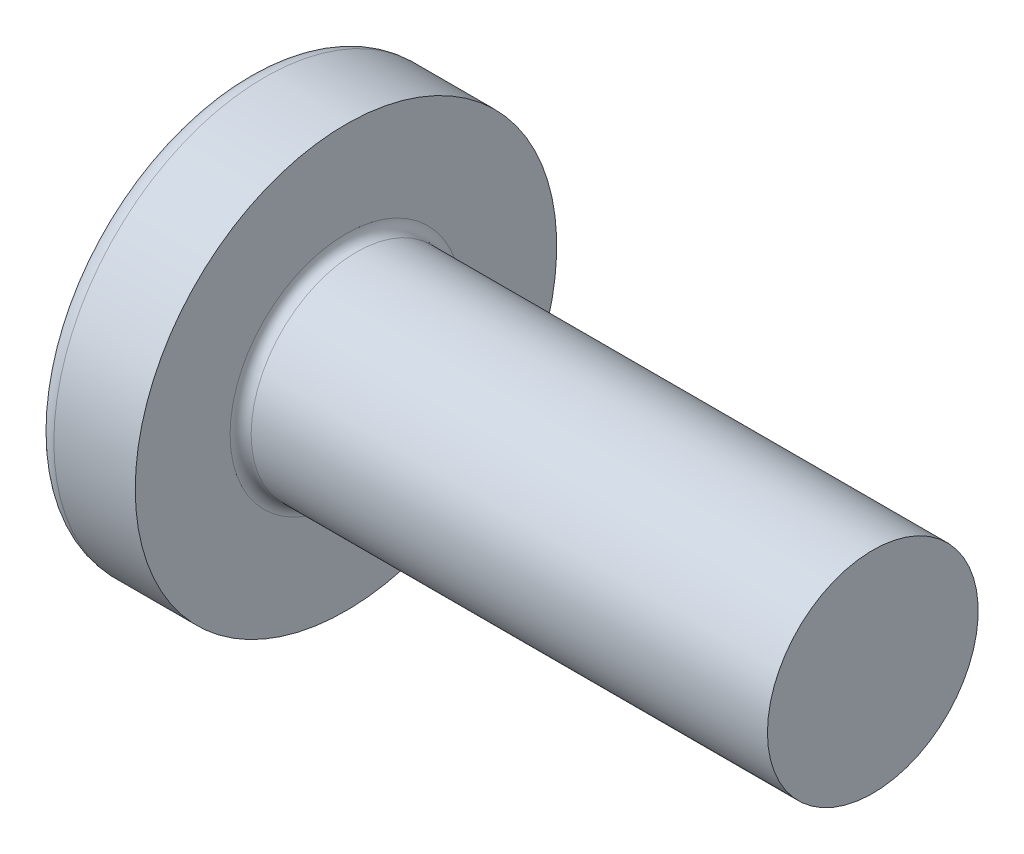
ISO-10303-21;
HEADER;
FILE_DESCRIPTION(('STEP AP214'),'2;1');
FILE_NAME('part.step','',(''),(''),'','','');
FILE_SCHEMA(('AUTOMOTIVE_DESIGN { 1 0 10303 214 1 1 1 1 }'));
ENDSEC;
DATA;
#1=APPLICATION_CONTEXT('core data for automotive mechanical design processes');
#2=APPLICATION_PROTOCOL_DEFINITION('international standard','automotive_design',2000,#1);
#3=PRODUCT_CONTEXT('',#1,'mechanical');
#4=PRODUCT('Part','Part','',(#3));
#5=PRODUCT_RELATED_PRODUCT_CATEGORY('part','',(#4));
#6=PRODUCT_DEFINITION_FORMATION('','',#4);
#7=PRODUCT_DEFINITION_CONTEXT('part definition',#1,'design');
#8=PRODUCT_DEFINITION('design','',#6,#7);
#9=PRODUCT_DEFINITION_SHAPE('','',#8);
#10=(LENGTH_UNIT() NAMED_UNIT(*) SI_UNIT(.MILLI.,.METRE.));
#11=(NAMED_UNIT(*) PLANE_ANGLE_UNIT() SI_UNIT($,.RADIAN.));
#12=(NAMED_UNIT(*) SI_UNIT($,.STERADIAN.) SOLID_ANGLE_UNIT());
#13=UNCERTAINTY_MEASURE_WITH_UNIT(LENGTH_MEASURE(1.E-05),#10,'distance_accuracy_value','');
#14=(GEOMETRIC_REPRESENTATION_CONTEXT(3) GLOBAL_UNCERTAINTY_ASSIGNED_CONTEXT((#13)) GLOBAL_UNIT_ASSIGNED_CONTEXT((#10,
#11,#12)) REPRESENTATION_CONTEXT('',''));
#15=CARTESIAN_POINT('',(0.,0.,0.));
#16=DIRECTION('',(0.,0.,1.));
#17=DIRECTION('',(1.,0.,0.));
#18=AXIS2_PLACEMENT_3D('',#15,#16,#17);
#19=CARTESIAN_POINT('',(6.5,0.,0.));
#20=DIRECTION('',(-1.,0.,0.));
#21=DIRECTION('',(0.,1.,0.));
#22=AXIS2_PLACEMENT_3D('',#19,#20,#21);
#23=SPHERICAL_SURFACE('',#22,6.5);
#24=CARTESIAN_POINT('',(1.26538895452803,0.,0.));
#25=DIRECTION('',(-1.,0.,0.));
#26=DIRECTION('',(0.,0.,1.));
#27=AXIS2_PLACEMENT_3D('',#24,#25,#26);
#28=CIRCLE('',#27,3.85342019543974);
#29=CARTESIAN_POINT('',(1.26538895452803,0.,3.85342019543974));
#30=VERTEX_POINT('',#29);
#31=EDGE_CURVE('E213',#30,#30,#28,.T.);
#32=ORIENTED_EDGE('',*,*,#31,.T.);
#33=EDGE_LOOP('',(#32));
#34=FACE_BOUND('',#33,.T.);
#35=CARTESIAN_POINT('',(0.0788099820016241,0.,0.));
#36=DIRECTION('',(1.,0.,0.));
#37=DIRECTION('',(0.,0.,-1.));
#38=AXIS2_PLACEMENT_3D('',#35,#36,#37);
#39=CIRCLE('',#38,1.0091178091571);
#40=CARTESIAN_POINT('',(0.0788099820016244,-0.514999999999996,-0.867809744562728));
#41=VERTEX_POINT('',#40);
#42=CARTESIAN_POINT('',(0.0788099820016241,-0.867809744562729,-0.515));
#43=VERTEX_POINT('',#42);
#44=EDGE_CURVE('E340',#41,#43,#39,.F.);
#45=ORIENTED_EDGE('',*,*,#44,.F.);
#46=CARTESIAN_POINT('',(6.5,-0.515000000000001,0.));
#47=DIRECTION('',(0.,1.,0.));
#48=DIRECTION('',(0.,0.,1.));
#49=AXIS2_PLACEMENT_3D('',#46,#47,#48);
#50=CIRCLE('',#49,6.47956595768575);
#51=CARTESIAN_POINT('',(0.331830520157854,-0.514999999999992,-1.98455543332603));
#52=VERTEX_POINT('',#51);
#53=EDGE_CURVE('E273',#52,#41,#50,.T.);
#54=ORIENTED_EDGE('',*,*,#53,.F.);
#55=CARTESIAN_POINT('',(6.06443225879603,0.,0.873613881878153));
#56=DIRECTION('',(0.446197753347436,0.,-0.894934391398443));
#57=DIRECTION('',(-0.894934391398442,0.,-0.446197753347436));
#58=AXIS2_PLACEMENT_3D('',#55,#56,#57);
#59=CIRCLE('',#58,6.42628038045433);
#60=CARTESIAN_POINT('',(0.331830520157856,0.515000000000007,-1.98455543332603));
#61=VERTEX_POINT('',#60);
#62=EDGE_CURVE('E247',#52,#61,#59,.T.);
#63=ORIENTED_EDGE('',*,*,#62,.T.);
#64=CARTESIAN_POINT('',(6.5,0.515,0.));
#65=DIRECTION('',(0.,-1.,0.));
#66=DIRECTION('',(0.,0.,-1.));
#67=AXIS2_PLACEMENT_3D('',#64,#65,#66);
#68=CIRCLE('',#67,6.47956595768574);
#69=CARTESIAN_POINT('',(0.0788099820016249,0.515000000000003,-0.867809744562724));
#70=VERTEX_POINT('',#69);
#71=EDGE_CURVE('E302',#70,#61,#68,.T.);
#72=ORIENTED_EDGE('',*,*,#71,.F.);
#73=CARTESIAN_POINT('',(0.0788099820016241,0.867809744562719,-0.515));
#74=VERTEX_POINT('',#73);
#75=EDGE_CURVE('E355',#74,#70,#39,.F.);
#76=ORIENTED_EDGE('',*,*,#75,.F.);
#77=CARTESIAN_POINT('',(6.5,0.,-0.515));
#78=DIRECTION('',(0.,0.,1.));
#79=DIRECTION('',(1.,0.,0.));
#80=AXIS2_PLACEMENT_3D('',#77,#78,#79);
#81=CIRCLE('',#80,6.47956595768574);
#82=CARTESIAN_POINT('',(0.331830520157856,1.98455543332603,-0.515));
#83=VERTEX_POINT('',#82);
#84=EDGE_CURVE('E241',#83,#74,#81,.T.);
#85=ORIENTED_EDGE('',*,*,#84,.F.);
#86=CARTESIAN_POINT('',(6.06443225879604,-0.873613881878154,0.));
#87=DIRECTION('',(0.446197753347436,0.894934391398443,0.));
#88=DIRECTION('',(-0.894934391398442,0.446197753347436,0.));
#89=AXIS2_PLACEMENT_3D('',#86,#87,#88);
#90=CIRCLE('',#89,6.42628038045433);
#91=CARTESIAN_POINT('',(0.331830520157857,1.98455543332603,0.515));
#92=VERTEX_POINT('',#91);
#93=EDGE_CURVE('E244',#83,#92,#90,.T.);
#94=ORIENTED_EDGE('',*,*,#93,.T.);
#95=CARTESIAN_POINT('',(6.5,0.,0.515000000000001));
#96=DIRECTION('',(0.,0.,-1.));
#97=DIRECTION('',(-1.,0.,0.));
#98=AXIS2_PLACEMENT_3D('',#95,#96,#97);
#99=CIRCLE('',#98,6.47956595768574);
#100=CARTESIAN_POINT('',(0.0788099820016241,0.867809744562719,0.514999999999999));
#101=VERTEX_POINT('',#100);
#102=EDGE_CURVE('E237',#101,#92,#99,.T.);
#103=ORIENTED_EDGE('',*,*,#102,.F.);
#104=CARTESIAN_POINT('',(0.0788099820016253,0.514999999999997,0.867809744562727));
#105=VERTEX_POINT('',#104);
#106=EDGE_CURVE('E354',#105,#101,#39,.F.);
#107=ORIENTED_EDGE('',*,*,#106,.F.);
#108=CARTESIAN_POINT('',(0.331830520157856,0.514999999999993,1.98455543332603));
#109=VERTEX_POINT('',#108);
#110=EDGE_CURVE('E257',#109,#105,#68,.T.);
#111=ORIENTED_EDGE('',*,*,#110,.F.);
#112=CARTESIAN_POINT('',(6.06443225879603,0.,-0.873613881878153));
#113=DIRECTION('',(0.446197753347436,0.,0.894934391398443));
#114=DIRECTION('',(0.894934391398442,0.,-0.446197753347436));
#115=AXIS2_PLACEMENT_3D('',#112,#113,#114);
#116=CIRCLE('',#115,6.42628038045433);
#117=CARTESIAN_POINT('',(0.331830520157855,-0.515000000000007,1.98455543332603));
#118=VERTEX_POINT('',#117);
#119=EDGE_CURVE('E48',#109,#118,#116,.T.);
#120=ORIENTED_EDGE('',*,*,#119,.T.);
#121=CARTESIAN_POINT('',(0.0788099820016247,-0.515000000000003,0.867809744562724));
#122=VERTEX_POINT('',#121);
#123=EDGE_CURVE('E254',#122,#118,#50,.T.);
#124=ORIENTED_EDGE('',*,*,#123,.F.);
#125=CARTESIAN_POINT('',(0.0788099820016241,-0.867809744562729,0.514999999999999));
#126=VERTEX_POINT('',#125);
#127=EDGE_CURVE('E390',#126,#122,#39,.F.);
#128=ORIENTED_EDGE('',*,*,#127,.F.);
#129=CARTESIAN_POINT('',(0.331830520157853,-1.98455543332603,0.514999999999999));
#130=VERTEX_POINT('',#129);
#131=EDGE_CURVE('E238',#130,#126,#99,.T.);
#132=ORIENTED_EDGE('',*,*,#131,.F.);
#133=CARTESIAN_POINT('',(6.06443225879603,0.873613881878152,0.));
#134=DIRECTION('',(0.446197753347436,-0.894934391398443,0.));
#135=DIRECTION('',(0.894934391398442,0.446197753347436,0.));
#136=AXIS2_PLACEMENT_3D('',#133,#134,#135);
#137=CIRCLE('',#136,6.42628038045433);
#138=CARTESIAN_POINT('',(0.331830520157853,-1.98455543332603,-0.515));
#139=VERTEX_POINT('',#138);
#140=EDGE_CURVE('E234',#130,#139,#137,.T.);
#141=ORIENTED_EDGE('',*,*,#140,.T.);
#142=EDGE_CURVE('E63',#43,#139,#81,.T.);
#143=ORIENTED_EDGE('',*,*,#142,.F.);
#144=EDGE_LOOP('',(#45,#54,#63,#72,#76,#85,#94,#103,#107,#111,#120,#124,#128,#132,#141,#143));
#145=FACE_BOUND('',#144,.T.);
#146=ADVANCED_FACE('F34',(#34,#145),#23,.T.);
#147=CARTESIAN_POINT('',(0.,2.15,-0.515));
#148=DIRECTION('',(0.,0.,1.));
#149=DIRECTION('',(1.,0.,0.));
#150=AXIS2_PLACEMENT_3D('',#147,#148,#149);
#151=PLANE('',#150);
#152=ORIENTED_EDGE('',*,*,#84,.T.);
#153=CARTESIAN_POINT('',(-1.51195208675156,0.994972220320188,-0.515));
#154=CARTESIAN_POINT('',(-1.20405981949279,0.970722016949958,-0.515));
#155=CARTESIAN_POINT('',(-0.896180907521174,0.946299109919651,-0.515));
#156=CARTESIAN_POINT('',(-0.280449079832185,0.896981122427851,-0.515));
#157=CARTESIAN_POINT('',(0.0274038344396872,0.872086023934883,-0.515));
#158=CARTESIAN_POINT('',(0.489146739515351,0.83429553519528,-0.515));
#159=CARTESIAN_POINT('',(0.643055047553846,0.821624058404092,-0.515));
#160=CARTESIAN_POINT('',(0.950856520197141,0.796108332639504,-0.515));
#161=CARTESIAN_POINT('',(1.10474968487868,0.783264084592466,-0.515));
#162=CARTESIAN_POINT('',(1.41251352095103,0.757376569093378,-0.515));
#163=CARTESIAN_POINT('',(1.56638419296577,0.744333309065218,-0.515));
#164=CARTESIAN_POINT('',(1.87410847343335,0.718013273188896,-0.515));
#165=CARTESIAN_POINT('',(2.02796208151372,0.704736492982792,-0.515));
#166=CARTESIAN_POINT('',(2.36455311890989,0.675386943006726,-0.515));
#167=CARTESIAN_POINT('',(2.54728562293342,0.659257575640986,-0.515));
#168=CARTESIAN_POINT('',(2.91270624109256,0.626517182479888,-0.515));
#169=CARTESIAN_POINT('',(3.09539435554038,0.609906160177238,-0.515));
#170=CARTESIAN_POINT('',(3.46069832191612,0.576073027116421,-0.515));
#171=CARTESIAN_POINT('',(3.64331417870068,0.558850968932727,-0.515));
#172=CARTESIAN_POINT('',(4.00847437496567,0.523604864540037,-0.515));
#173=CARTESIAN_POINT('',(4.19101871216888,0.505580794604253,-0.515));
#174=CARTESIAN_POINT('',(4.55606208157937,0.468429191666488,-0.515));
#175=CARTESIAN_POINT('',(4.73856107358022,0.449301262281853,-0.515));
#176=CARTESIAN_POINT('',(5.10337547353418,0.409473604748924,-0.515));
#177=CARTESIAN_POINT('',(5.28569089526422,0.38877400510607,-0.515));
#178=CARTESIAN_POINT('',(5.55897278495411,0.355828287527264,-0.515));
#179=CARTESIAN_POINT('',(5.65005277419685,0.344527918782738,-0.515));
#180=CARTESIAN_POINT('',(5.83209904103607,0.321075174263031,-0.515));
#181=CARTESIAN_POINT('',(5.92306532397915,0.308922840209686,-0.515));
#182=CARTESIAN_POINT('',(6.10486078872898,0.28342733445193,-0.515));
#183=CARTESIAN_POINT('',(6.19568992299379,0.270083817601714,-0.515));
#184=CARTESIAN_POINT('',(6.33172773785679,0.248701420809951,-0.515));
#185=CARTESIAN_POINT('',(6.37704304473344,0.241345446705304,-0.515));
#186=CARTESIAN_POINT('',(6.4675722520141,0.226018953559338,-0.515));
#187=CARTESIAN_POINT('',(6.51278614568082,0.218048394864476,-0.515));
#188=CARTESIAN_POINT('',(6.55793125759548,0.209691465274945,-0.515));
#189=B_SPLINE_CURVE_WITH_KNOTS('',3,(#153,#154,#155,#156,#157,#158,#159,#160,#161,#162,#163,
#164,#165,#166,#167,#168,#169,#170,#171,#172,#173,#174,#175,#176,#177,#178,#179,#180,#181,#182,
#183,#184,#185,#186,#187,#188),.UNSPECIFIED.,.F.,.F.,(4,2,2,2,2,2,2,2,2,2,2,2,2,2,2,2,2,4),(0.,
0.926537709781721,1.85311087258339,2.31639796016285,2.77968256468771,3.24294992902054,
3.70622594801777,4.25655436065378,4.80687878359543,5.35715597005738,5.90744944680718,
6.45794177197673,7.00838913527399,7.28372117336898,7.5590397375059,7.83443833587748,
7.97216007460854,8.10989070671571),.UNSPECIFIED.);
#190=CARTESIAN_POINT('',(2.34,0.677477674908923,-0.515));
#191=VERTEX_POINT('',#190);
#192=EDGE_CURVE('E377',#74,#191,#189,.T.);
#193=ORIENTED_EDGE('',*,*,#192,.T.);
#194=DIRECTION('',(0.,1.,0.));
#195=VECTOR('',#194,1.);
#196=CARTESIAN_POINT('',(2.34,-0.983319232260742,-0.515));
#197=LINE('',#196,#195);
#198=CARTESIAN_POINT('',(2.34,0.983319232260743,-0.515));
#199=VERTEX_POINT('',#198);
#200=EDGE_CURVE('E323',#191,#199,#197,.T.);
#201=ORIENTED_EDGE('',*,*,#200,.T.);
#202=DIRECTION('',(0.894934391398442,-0.446197753347436,0.));
#203=VECTOR('',#202,1.);
#204=CARTESIAN_POINT('',(0.,2.15,-0.515));
#205=LINE('',#204,#203);
#206=EDGE_CURVE('E214',#83,#199,#205,.T.);
#207=ORIENTED_EDGE('',*,*,#206,.F.);
#208=EDGE_LOOP('',(#152,#193,#201,#207));
#209=FACE_BOUND('',#208,.T.);
#210=ADVANCED_FACE('F169',(#209),#151,.T.);
#211=CARTESIAN_POINT('',(2.34,-0.983319232260742,-0.515));
#212=VERTEX_POINT('',#211);
#213=CARTESIAN_POINT('',(2.34,-0.677477674908923,-0.515));
#214=VERTEX_POINT('',#213);
#215=EDGE_CURVE('E222',#212,#214,#197,.T.);
#216=ORIENTED_EDGE('',*,*,#215,.T.);
#217=CARTESIAN_POINT('',(-1.51195208675156,-0.994972220320188,-0.515));
#218=CARTESIAN_POINT('',(-1.20405981949279,-0.970722016949958,-0.515));
#219=CARTESIAN_POINT('',(-0.896180907521174,-0.946299109919651,-0.515));
#220=CARTESIAN_POINT('',(-0.280449079832185,-0.896981122427851,-0.515));
#221=CARTESIAN_POINT('',(0.027403834439687,-0.872086023934883,-0.515));
#222=CARTESIAN_POINT('',(0.48914673951535,-0.83429553519528,-0.515));
#223=CARTESIAN_POINT('',(0.643055047553845,-0.821624058404092,-0.515));
#224=CARTESIAN_POINT('',(0.95085652019714,-0.796108332639504,-0.515));
#225=CARTESIAN_POINT('',(1.10474968487868,-0.783264084592466,-0.515));
#226=CARTESIAN_POINT('',(1.41251352095103,-0.757376569093378,-0.515));
#227=CARTESIAN_POINT('',(1.56638419296577,-0.744333309065218,-0.515));
#228=CARTESIAN_POINT('',(1.87410847343335,-0.718013273188896,-0.515));
#229=CARTESIAN_POINT('',(2.02796208151372,-0.704736492982792,-0.515));
#230=CARTESIAN_POINT('',(2.36455311890989,-0.675386943006726,-0.515));
#231=CARTESIAN_POINT('',(2.54728562293342,-0.659257575640986,-0.515));
#232=CARTESIAN_POINT('',(2.91270624109256,-0.626517182479888,-0.515));
#233=CARTESIAN_POINT('',(3.09539435554038,-0.609906160177238,-0.515));
#234=CARTESIAN_POINT('',(3.46069832191613,-0.576073027116421,-0.515));
#235=CARTESIAN_POINT('',(3.64331417870068,-0.558850968932727,-0.515));
#236=CARTESIAN_POINT('',(4.00847437496567,-0.523604864540037,-0.515));
#237=CARTESIAN_POINT('',(4.19101871216888,-0.505580794604252,-0.515));
#238=CARTESIAN_POINT('',(4.55606208157937,-0.468429191666487,-0.515));
#239=CARTESIAN_POINT('',(4.73856107358023,-0.449301262281853,-0.515));
#240=CARTESIAN_POINT('',(5.10337547353419,-0.409473604748924,-0.515));
#241=CARTESIAN_POINT('',(5.28569089526422,-0.388774005106069,-0.515));
#242=CARTESIAN_POINT('',(5.55897278495412,-0.355828287527264,-0.515));
#243=CARTESIAN_POINT('',(5.65005277419686,-0.344527918782738,-0.515));
#244=CARTESIAN_POINT('',(5.83209904103608,-0.32107517426303,-0.515));
#245=CARTESIAN_POINT('',(5.92306532397915,-0.308922840209685,-0.515));
#246=CARTESIAN_POINT('',(6.10486078872898,-0.283427334451929,-0.515));
#247=CARTESIAN_POINT('',(6.1956899229938,-0.270083817601713,-0.515));
#248=CARTESIAN_POINT('',(6.33172773785679,-0.24870142080995,-0.515));
#249=CARTESIAN_POINT('',(6.37704304473344,-0.241345446705303,-0.515));
#250=CARTESIAN_POINT('',(6.4675722520141,-0.226018953559337,-0.515));
#251=CARTESIAN_POINT('',(6.51278614568083,-0.218048394864475,-0.515));
#252=CARTESIAN_POINT('',(6.55793125759549,-0.209691465274944,-0.515));
#253=B_SPLINE_CURVE_WITH_KNOTS('',3,(#217,#218,#219,#220,#221,#222,#223,#224,#225,#226,#227,
#228,#229,#230,#231,#232,#233,#234,#235,#236,#237,#238,#239,#240,#241,#242,#243,#244,#245,#246,
#247,#248,#249,#250,#251,#252),.UNSPECIFIED.,.F.,.F.,(4,2,2,2,2,2,2,2,2,2,2,2,2,2,2,2,2,4),(0.,
0.926537709781721,1.85311087258339,2.31639796016285,2.77968256468771,3.24294992902054,
3.70622594801777,4.25655436065378,4.80687878359543,5.35715597005738,5.90744944680718,
6.45794177197673,7.008389135274,7.28372117336899,7.55903973750591,7.83443833587749,
7.97216007460855,8.10989070671571),.UNSPECIFIED.);
#254=EDGE_CURVE('E353',#214,#43,#253,.F.);
#255=ORIENTED_EDGE('',*,*,#254,.T.);
#256=ORIENTED_EDGE('',*,*,#142,.T.);
#257=DIRECTION('',(0.894934391398442,0.446197753347436,0.));
#258=VECTOR('',#257,1.);
#259=CARTESIAN_POINT('',(0.,-2.15,-0.515));
#260=LINE('',#259,#258);
#261=EDGE_CURVE('E305',#139,#212,#260,.T.);
#262=ORIENTED_EDGE('',*,*,#261,.T.);
#263=EDGE_LOOP('',(#216,#255,#256,#262));
#264=FACE_BOUND('',#263,.T.);
#265=ADVANCED_FACE('F175',(#264),#151,.T.);
#266=CARTESIAN_POINT('',(0.,-2.15,0.514999999999999));
#267=DIRECTION('',(0.,0.,-1.));
#268=DIRECTION('',(-1.,0.,0.));
#269=AXIS2_PLACEMENT_3D('',#266,#267,#268);
#270=PLANE('',#269);
#271=DIRECTION('',(0.,-1.,0.));
#272=VECTOR('',#271,1.);
#273=CARTESIAN_POINT('',(2.34,0.983319232260742,0.515));
#274=LINE('',#273,#272);
#275=CARTESIAN_POINT('',(2.34,0.983319232260743,0.515));
#276=VERTEX_POINT('',#275);
#277=CARTESIAN_POINT('',(2.34,0.677477674908923,0.515));
#278=VERTEX_POINT('',#277);
#279=EDGE_CURVE('E313',#276,#278,#274,.T.);
#280=ORIENTED_EDGE('',*,*,#279,.T.);
#281=CARTESIAN_POINT('',(-1.51195208675156,0.994972220320188,0.514999999999999));
#282=CARTESIAN_POINT('',(-1.20405981949279,0.970722016949958,0.514999999999999));
#283=CARTESIAN_POINT('',(-0.896180907521173,0.946299109919651,0.514999999999999));
#284=CARTESIAN_POINT('',(-0.280449079832185,0.896981122427852,0.514999999999999));
#285=CARTESIAN_POINT('',(0.0274038344396875,0.872086023934883,0.514999999999999));
#286=CARTESIAN_POINT('',(0.489146739515351,0.83429553519528,0.515));
#287=CARTESIAN_POINT('',(0.643055047553846,0.821624058404092,0.515));
#288=CARTESIAN_POINT('',(0.950856520197141,0.796108332639504,0.515));
#289=CARTESIAN_POINT('',(1.10474968487868,0.783264084592466,0.515));
#290=CARTESIAN_POINT('',(1.41251352095103,0.757376569093378,0.515));
#291=CARTESIAN_POINT('',(1.56638419296577,0.744333309065218,0.515));
#292=CARTESIAN_POINT('',(1.87410847343335,0.718013273188896,0.515));
#293=CARTESIAN_POINT('',(2.02796208151372,0.704736492982792,0.515));
#294=CARTESIAN_POINT('',(2.36455311890989,0.675386943006726,0.515));
#295=CARTESIAN_POINT('',(2.54728562293342,0.659257575640986,0.515));
#296=CARTESIAN_POINT('',(2.91270624109256,0.626517182479888,0.515));
#297=CARTESIAN_POINT('',(3.09539435554038,0.609906160177238,0.515));
#298=CARTESIAN_POINT('',(3.46069832191613,0.576073027116421,0.515));
#299=CARTESIAN_POINT('',(3.64331417870068,0.558850968932727,0.515));
#300=CARTESIAN_POINT('',(4.00847437496567,0.523604864540037,0.515));
#301=CARTESIAN_POINT('',(4.19101871216888,0.505580794604252,0.515));
#302=CARTESIAN_POINT('',(4.55606208157937,0.468429191666487,0.515));
#303=CARTESIAN_POINT('',(4.73856107358023,0.449301262281853,0.515000000000001));
#304=CARTESIAN_POINT('',(5.10337547353419,0.409473604748923,0.515000000000001));
#305=CARTESIAN_POINT('',(5.28569089526422,0.388774005106068,0.515000000000001));
#306=CARTESIAN_POINT('',(5.55897278495412,0.355828287527263,0.515000000000001));
#307=CARTESIAN_POINT('',(5.65005277419686,0.344527918782737,0.515000000000001));
#308=CARTESIAN_POINT('',(5.83209904103608,0.32107517426303,0.515000000000001));
#309=CARTESIAN_POINT('',(5.92306532397915,0.308922840209685,0.515000000000001));
#310=CARTESIAN_POINT('',(6.10486078872898,0.283427334451929,0.515000000000001));
#311=CARTESIAN_POINT('',(6.1956899229938,0.270083817601713,0.515000000000001));
#312=CARTESIAN_POINT('',(6.33172773785679,0.248701420809949,0.515000000000001));
#313=CARTESIAN_POINT('',(6.37704304473344,0.241345446705302,0.515000000000001));
#314=CARTESIAN_POINT('',(6.4675722520141,0.226018953559336,0.515000000000001));
#315=CARTESIAN_POINT('',(6.51278614568083,0.218048394864474,0.515000000000001));
#316=CARTESIAN_POINT('',(6.55793125759549,0.209691465274942,0.515000000000001));
#317=B_SPLINE_CURVE_WITH_KNOTS('',3,(#281,#282,#283,#284,#285,#286,#287,#288,#289,#290,#291,
#292,#293,#294,#295,#296,#297,#298,#299,#300,#301,#302,#303,#304,#305,#306,#307,#308,#309,#310,
#311,#312,#313,#314,#315,#316),.UNSPECIFIED.,.F.,.F.,(4,2,2,2,2,2,2,2,2,2,2,2,2,2,2,2,2,4),(0.,
0.926537709781721,1.85311087258339,2.31639796016285,2.77968256468771,3.24294992902054,
3.70622594801777,4.25655436065378,4.80687878359543,5.35715597005738,5.90744944680718,
6.45794177197673,7.008389135274,7.28372117336899,7.55903973750591,7.83443833587749,
7.97216007460855,8.10989070671571),.UNSPECIFIED.);
#318=EDGE_CURVE('E278',#278,#101,#317,.F.);
#319=ORIENTED_EDGE('',*,*,#318,.T.);
#320=ORIENTED_EDGE('',*,*,#102,.T.);
#321=DIRECTION('',(0.894934391398442,-0.446197753347436,0.));
#322=VECTOR('',#321,1.);
#323=CARTESIAN_POINT('',(0.,2.15,0.515));
#324=LINE('',#323,#322);
#325=EDGE_CURVE('E219',#92,#276,#324,.T.);
#326=ORIENTED_EDGE('',*,*,#325,.T.);
#327=EDGE_LOOP('',(#280,#319,#320,#326));
#328=FACE_BOUND('',#327,.T.);
#329=ADVANCED_FACE('F373',(#328),#270,.T.);
#330=ORIENTED_EDGE('',*,*,#131,.T.);
#331=CARTESIAN_POINT('',(-1.51195208675156,-0.994972220320188,0.514999999999999));
#332=CARTESIAN_POINT('',(-1.20405981949279,-0.970722016949958,0.514999999999999));
#333=CARTESIAN_POINT('',(-0.896180907521174,-0.946299109919651,0.514999999999999));
#334=CARTESIAN_POINT('',(-0.280449079832185,-0.896981122427852,0.514999999999999));
#335=CARTESIAN_POINT('',(0.0274038344396874,-0.872086023934883,0.514999999999999));
#336=CARTESIAN_POINT('',(0.489146739515351,-0.83429553519528,0.514999999999999));
#337=CARTESIAN_POINT('',(0.643055047553846,-0.821624058404092,0.514999999999999));
#338=CARTESIAN_POINT('',(0.950856520197141,-0.796108332639504,0.514999999999999));
#339=CARTESIAN_POINT('',(1.10474968487868,-0.783264084592466,0.515));
#340=CARTESIAN_POINT('',(1.41251352095103,-0.757376569093379,0.515));
#341=CARTESIAN_POINT('',(1.56638419296577,-0.744333309065218,0.515));
#342=CARTESIAN_POINT('',(1.87410847343335,-0.718013273188896,0.515));
#343=CARTESIAN_POINT('',(2.02796208151372,-0.704736492982792,0.515));
#344=CARTESIAN_POINT('',(2.36455311890989,-0.675386943006726,0.515));
#345=CARTESIAN_POINT('',(2.54728562293342,-0.659257575640986,0.515));
#346=CARTESIAN_POINT('',(2.91270624109256,-0.626517182479888,0.515));
#347=CARTESIAN_POINT('',(3.09539435554038,-0.609906160177238,0.515));
#348=CARTESIAN_POINT('',(3.46069832191613,-0.576073027116421,0.515));
#349=CARTESIAN_POINT('',(3.64331417870068,-0.558850968932727,0.515));
#350=CARTESIAN_POINT('',(4.00847437496567,-0.523604864540037,0.515));
#351=CARTESIAN_POINT('',(4.19101871216888,-0.505580794604253,0.515));
#352=CARTESIAN_POINT('',(4.55606208157937,-0.468429191666487,0.515));
#353=CARTESIAN_POINT('',(4.73856107358022,-0.449301262281853,0.515));
#354=CARTESIAN_POINT('',(5.10337547353418,-0.409473604748924,0.515));
#355=CARTESIAN_POINT('',(5.28569089526422,-0.388774005106069,0.515));
#356=CARTESIAN_POINT('',(5.55897278495412,-0.355828287527263,0.515000000000001));
#357=CARTESIAN_POINT('',(5.65005277419686,-0.344527918782738,0.515000000000001));
#358=CARTESIAN_POINT('',(5.83209904103607,-0.32107517426303,0.515000000000001));
#359=CARTESIAN_POINT('',(5.92306532397915,-0.308922840209685,0.515000000000001));
#360=CARTESIAN_POINT('',(6.10486078872898,-0.283427334451929,0.515000000000001));
#361=CARTESIAN_POINT('',(6.19568992299379,-0.270083817601713,0.515000000000001));
#362=CARTESIAN_POINT('',(6.33172773785679,-0.24870142080995,0.515000000000001));
#363=CARTESIAN_POINT('',(6.37704304473344,-0.241345446705303,0.515000000000001));
#364=CARTESIAN_POINT('',(6.4675722520141,-0.226018953559336,0.515000000000001));
#365=CARTESIAN_POINT('',(6.51278614568083,-0.218048394864474,0.515000000000001));
#366=CARTESIAN_POINT('',(6.55793125759549,-0.209691465274943,0.515000000000001));
#367=B_SPLINE_CURVE_WITH_KNOTS('',3,(#331,#332,#333,#334,#335,#336,#337,#338,#339,#340,#341,
#342,#343,#344,#345,#346,#347,#348,#349,#350,#351,#352,#353,#354,#355,#356,#357,#358,#359,#360,
#361,#362,#363,#364,#365,#366),.UNSPECIFIED.,.F.,.F.,(4,2,2,2,2,2,2,2,2,2,2,2,2,2,2,2,2,4),(0.,
0.926537709781721,1.85311087258339,2.31639796016285,2.77968256468771,3.24294992902055,
3.70622594801777,4.25655436065378,4.80687878359543,5.35715597005738,5.90744944680718,
6.45794177197673,7.008389135274,7.28372117336899,7.55903973750591,7.83443833587748,
7.97216007460854,8.10989070671571),.UNSPECIFIED.);
#368=CARTESIAN_POINT('',(2.34,-0.677477674908923,0.515));
#369=VERTEX_POINT('',#368);
#370=EDGE_CURVE('E391',#126,#369,#367,.T.);
#371=ORIENTED_EDGE('',*,*,#370,.T.);
#372=CARTESIAN_POINT('',(2.34,-0.983319232260743,0.515));
#373=VERTEX_POINT('',#372);
#374=EDGE_CURVE('E315',#369,#373,#274,.T.);
#375=ORIENTED_EDGE('',*,*,#374,.T.);
#376=DIRECTION('',(0.894934391398443,0.446197753347436,0.));
#377=VECTOR('',#376,1.);
#378=CARTESIAN_POINT('',(0.,-2.15,0.514999999999999));
#379=LINE('',#378,#377);
#380=EDGE_CURVE('E307',#130,#373,#379,.T.);
#381=ORIENTED_EDGE('',*,*,#380,.F.);
#382=EDGE_LOOP('',(#330,#371,#375,#381));
#383=FACE_BOUND('',#382,.T.);
#384=ADVANCED_FACE('F419',(#383),#270,.T.);
#385=CARTESIAN_POINT('',(2.34,0.983319232260742,-0.515));
#386=DIRECTION('',(-1.,0.,0.));
#387=DIRECTION('',(0.,0.,1.));
#388=AXIS2_PLACEMENT_3D('',#385,#386,#387);
#389=PLANE('',#388);
#390=ORIENTED_EDGE('',*,*,#374,.F.);
#391=CARTESIAN_POINT('',(2.34,0.,0.));
#392=DIRECTION('',(-1.,0.,0.));
#393=DIRECTION('',(0.,0.,1.));
#394=AXIS2_PLACEMENT_3D('',#391,#392,#393);
#395=CIRCLE('',#394,0.851);
#396=EDGE_CURVE('E348',#214,#369,#395,.T.);
#397=ORIENTED_EDGE('',*,*,#396,.F.);
#398=ORIENTED_EDGE('',*,*,#215,.F.);
#399=DIRECTION('',(0.,0.,1.));
#400=VECTOR('',#399,1.);
#401=CARTESIAN_POINT('',(2.34,-0.983319232260742,-0.515));
#402=LINE('',#401,#400);
#403=EDGE_CURVE('E310',#212,#373,#402,.T.);
#404=ORIENTED_EDGE('',*,*,#403,.T.);
#405=EDGE_LOOP('',(#390,#397,#398,#404));
#406=FACE_BOUND('',#405,.T.);
#407=ADVANCED_FACE('F417',(#406),#389,.T.);
#408=DIRECTION('',(0.,0.,-1.));
#409=VECTOR('',#408,1.);
#410=CARTESIAN_POINT('',(2.34,-0.515000000000004,0.983319232260741));
#411=LINE('',#410,#409);
#412=CARTESIAN_POINT('',(2.34,-0.514999999999997,-0.677477674908925));
#413=VERTEX_POINT('',#412);
#414=CARTESIAN_POINT('',(2.34,-0.514999999999996,-0.983319232260744));
#415=VERTEX_POINT('',#414);
#416=EDGE_CURVE('E296',#413,#415,#411,.T.);
#417=ORIENTED_EDGE('',*,*,#416,.F.);
#418=CARTESIAN_POINT('',(2.34,0.515000000000003,-0.677477674908921));
#419=VERTEX_POINT('',#418);
#420=EDGE_CURVE('E55',#419,#413,#395,.T.);
#421=ORIENTED_EDGE('',*,*,#420,.F.);
#422=DIRECTION('',(0.,0.,1.));
#423=VECTOR('',#422,1.);
#424=CARTESIAN_POINT('',(2.34,0.515000000000004,-0.983319232260741));
#425=LINE('',#424,#423);
#426=CARTESIAN_POINT('',(2.34,0.515000000000004,-0.983319232260741));
#427=VERTEX_POINT('',#426);
#428=EDGE_CURVE('E299',#427,#419,#425,.T.);
#429=ORIENTED_EDGE('',*,*,#428,.F.);
#430=DIRECTION('',(0.,-1.,0.));
#431=VECTOR('',#430,1.);
#432=CARTESIAN_POINT('',(2.34,0.515000000000004,-0.983319232260741));
#433=LINE('',#432,#431);
#434=EDGE_CURVE('E290',#427,#415,#433,.T.);
#435=ORIENTED_EDGE('',*,*,#434,.T.);
#436=EDGE_LOOP('',(#417,#421,#429,#435));
#437=FACE_BOUND('',#436,.T.);
#438=ADVANCED_FACE('F343',(#437),#389,.T.);
#439=ORIENTED_EDGE('',*,*,#200,.F.);
#440=EDGE_CURVE('E347',#278,#191,#395,.T.);
#441=ORIENTED_EDGE('',*,*,#440,.F.);
#442=ORIENTED_EDGE('',*,*,#279,.F.);
#443=DIRECTION('',(0.,0.,-1.));
#444=VECTOR('',#443,1.);
#445=CARTESIAN_POINT('',(2.34,0.983319232260742,0.515));
#446=LINE('',#445,#444);
#447=EDGE_CURVE('E316',#276,#199,#446,.T.);
#448=ORIENTED_EDGE('',*,*,#447,.T.);
#449=EDGE_LOOP('',(#439,#441,#442,#448));
#450=FACE_BOUND('',#449,.T.);
#451=ADVANCED_FACE('F426',(#450),#389,.T.);
#452=CARTESIAN_POINT('',(2.34,0.514999999999998,0.677477674908924));
#453=VERTEX_POINT('',#452);
#454=CARTESIAN_POINT('',(2.34,0.514999999999997,0.983319232260744));
#455=VERTEX_POINT('',#454);
#456=EDGE_CURVE('E271',#453,#455,#425,.T.);
#457=ORIENTED_EDGE('',*,*,#456,.F.);
#458=CARTESIAN_POINT('',(2.34,-0.515000000000003,0.677477674908921));
#459=VERTEX_POINT('',#458);
#460=EDGE_CURVE('E351',#459,#453,#395,.T.);
#461=ORIENTED_EDGE('',*,*,#460,.F.);
#462=CARTESIAN_POINT('',(2.34,-0.515000000000004,0.983319232260741));
#463=VERTEX_POINT('',#462);
#464=EDGE_CURVE('E293',#463,#459,#411,.T.);
#465=ORIENTED_EDGE('',*,*,#464,.F.);
#466=DIRECTION('',(0.,1.,0.));
#467=VECTOR('',#466,1.);
#468=CARTESIAN_POINT('',(2.34,-0.515000000000004,0.983319232260741));
#469=LINE('',#468,#467);
#470=EDGE_CURVE('E297',#463,#455,#469,.T.);
#471=ORIENTED_EDGE('',*,*,#470,.T.);
#472=EDGE_LOOP('',(#457,#461,#465,#471));
#473=FACE_BOUND('',#472,.T.);
#474=ADVANCED_FACE('F421',(#473),#389,.T.);
#475=CARTESIAN_POINT('',(0.,0.514999999999993,2.15));
#476=DIRECTION('',(0.,-1.,0.));
#477=DIRECTION('',(1.,0.,0.));
#478=AXIS2_PLACEMENT_3D('',#475,#476,#477);
#479=PLANE('',#478);
#480=ORIENTED_EDGE('',*,*,#110,.T.);
#481=CARTESIAN_POINT('',(-1.51195208675156,0.514999999999997,0.994972220320189));
#482=CARTESIAN_POINT('',(-1.20405981949279,0.514999999999997,0.97072201694996));
#483=CARTESIAN_POINT('',(-0.896180907521173,0.514999999999997,0.946299109919652));
#484=CARTESIAN_POINT('',(-0.280449079832184,0.514999999999997,0.896981122427853));
#485=CARTESIAN_POINT('',(0.0274038344396879,0.514999999999997,0.872086023934884));
#486=CARTESIAN_POINT('',(0.489146739515351,0.514999999999997,0.834295535195282));
#487=CARTESIAN_POINT('',(0.643055047553846,0.514999999999997,0.821624058404094));
#488=CARTESIAN_POINT('',(0.950856520197141,0.514999999999997,0.796108332639506));
#489=CARTESIAN_POINT('',(1.10474968487868,0.514999999999997,0.783264084592467));
#490=CARTESIAN_POINT('',(1.41251352095103,0.514999999999997,0.75737656909338));
#491=CARTESIAN_POINT('',(1.56638419296577,0.514999999999997,0.74433330906522));
#492=CARTESIAN_POINT('',(1.87410847343335,0.514999999999998,0.718013273188897));
#493=CARTESIAN_POINT('',(2.02796208151372,0.514999999999998,0.704736492982794));
#494=CARTESIAN_POINT('',(2.36455311890989,0.514999999999998,0.675386943006728));
#495=CARTESIAN_POINT('',(2.54728562293342,0.514999999999998,0.659257575640987));
#496=CARTESIAN_POINT('',(2.91270624109256,0.514999999999998,0.626517182479889));
#497=CARTESIAN_POINT('',(3.09539435554038,0.514999999999998,0.60990616017724));
#498=CARTESIAN_POINT('',(3.46069832191613,0.514999999999998,0.576073027116423));
#499=CARTESIAN_POINT('',(3.64331417870068,0.514999999999998,0.558850968932729));
#500=CARTESIAN_POINT('',(4.00847437496567,0.514999999999998,0.523604864540039));
#501=CARTESIAN_POINT('',(4.19101871216888,0.514999999999998,0.505580794604254));
#502=CARTESIAN_POINT('',(4.55606208157937,0.514999999999999,0.468429191666489));
#503=CARTESIAN_POINT('',(4.73856107358023,0.514999999999999,0.449301262281855));
#504=CARTESIAN_POINT('',(5.10337547353419,0.514999999999999,0.409473604748926));
#505=CARTESIAN_POINT('',(5.28569089526422,0.514999999999999,0.388774005106071));
#506=CARTESIAN_POINT('',(5.55897278495412,0.514999999999999,0.355828287527265));
#507=CARTESIAN_POINT('',(5.65005277419686,0.514999999999999,0.344527918782739));
#508=CARTESIAN_POINT('',(5.83209904103608,0.514999999999999,0.321075174263032));
#509=CARTESIAN_POINT('',(5.92306532397915,0.514999999999999,0.308922840209687));
#510=CARTESIAN_POINT('',(6.10486078872898,0.514999999999999,0.283427334451931));
#511=CARTESIAN_POINT('',(6.19568992299379,0.514999999999999,0.270083817601715));
#512=CARTESIAN_POINT('',(6.33172773785679,0.514999999999999,0.248701420809952));
#513=CARTESIAN_POINT('',(6.37704304473344,0.514999999999999,0.241345446705305));
#514=CARTESIAN_POINT('',(6.4675722520141,0.514999999999999,0.226018953559339));
#515=CARTESIAN_POINT('',(6.51278614568083,0.514999999999999,0.218048394864478));
#516=CARTESIAN_POINT('',(6.55793125759549,0.515,0.209691465274946));
#517=B_SPLINE_CURVE_WITH_KNOTS('',3,(#481,#482,#483,#484,#485,#486,#487,#488,#489,#490,#491,
#492,#493,#494,#495,#496,#497,#498,#499,#500,#501,#502,#503,#504,#505,#506,#507,#508,#509,#510,
#511,#512,#513,#514,#515,#516),.UNSPECIFIED.,.F.,.F.,(4,2,2,2,2,2,2,2,2,2,2,2,2,2,2,2,2,4),(0.,
0.926537709781721,1.85311087258339,2.31639796016285,2.77968256468771,3.24294992902054,
3.70622594801777,4.25655436065378,4.80687878359543,5.35715597005738,5.90744944680718,
6.45794177197673,7.008389135274,7.28372117336899,7.55903973750591,7.83443833587748,
7.97216007460854,8.10989070671571),.UNSPECIFIED.);
#518=EDGE_CURVE('E440',#105,#453,#517,.T.);
#519=ORIENTED_EDGE('',*,*,#518,.T.);
#520=ORIENTED_EDGE('',*,*,#456,.T.);
#521=DIRECTION('',(0.894934391398442,0.,-0.446197753347436));
#522=VECTOR('',#521,1.);
#523=CARTESIAN_POINT('',(0.,0.514999999999993,2.15));
#524=LINE('',#523,#522);
#525=EDGE_CURVE('E264',#109,#455,#524,.T.);
#526=ORIENTED_EDGE('',*,*,#525,.F.);
#527=EDGE_LOOP('',(#480,#519,#520,#526));
#528=FACE_BOUND('',#527,.T.);
#529=ADVANCED_FACE('F268',(#528),#479,.T.);
#530=CARTESIAN_POINT('',(0.,-0.514999999999992,-2.15));
#531=DIRECTION('',(0.,1.,0.));
#532=DIRECTION('',(-1.,0.,0.));
#533=AXIS2_PLACEMENT_3D('',#530,#531,#532);
#534=PLANE('',#533);
#535=ORIENTED_EDGE('',*,*,#464,.T.);
#536=CARTESIAN_POINT('',(-1.51195208754037,-0.515000000000003,0.994972220382296));
#537=CARTESIAN_POINT('',(-1.20405982018868,-0.515000000000003,0.970722017005062));
#538=CARTESIAN_POINT('',(-0.896180908124144,-0.515000000000003,0.946299109967687));
#539=CARTESIAN_POINT('',(-0.280449080249313,-0.515000000000003,0.896981122461526));
#540=CARTESIAN_POINT('',(0.027403834115485,-0.515000000000003,0.872086023961263));
#541=CARTESIAN_POINT('',(0.489146739371409,-0.515000000000003,0.834295535207135));
#542=CARTESIAN_POINT('',(0.643055047497245,-0.515000000000003,0.821624058408794));
#543=CARTESIAN_POINT('',(0.950856520315204,-0.515000000000003,0.796108332629704));
#544=CARTESIAN_POINT('',(1.10474968508407,-0.515000000000003,0.783264084575316));
#545=CARTESIAN_POINT('',(1.41251352133103,-0.515000000000003,0.757376569061286));
#546=CARTESIAN_POINT('',(1.56638419343305,-0.515000000000003,0.744333309025532));
#547=CARTESIAN_POINT('',(1.87410847407519,-0.515000000000003,0.718013273133714));
#548=CARTESIAN_POINT('',(2.02796208224283,-0.515000000000002,0.704736492919708));
#549=CARTESIAN_POINT('',(2.36455311972626,-0.515000000000002,0.675386942934954));
#550=CARTESIAN_POINT('',(2.5472856237498,-0.515000000000002,0.659257575568566));
#551=CARTESIAN_POINT('',(2.91270624190895,-0.515000000000002,0.626517182406012));
#552=CARTESIAN_POINT('',(3.09539435635676,-0.515000000000002,0.609906160102553));
#553=CARTESIAN_POINT('',(3.46069832273244,-0.515000000000002,0.576073027039887));
#554=CARTESIAN_POINT('',(3.64331417951694,-0.515000000000002,0.558850968855155));
#555=CARTESIAN_POINT('',(4.00847437578178,-0.515000000000002,0.523604864460042));
#556=CARTESIAN_POINT('',(4.1910187129849,-0.515000000000002,0.505580794522874));
#557=CARTESIAN_POINT('',(4.55606208239526,-0.515000000000002,0.468429191581778));
#558=CARTESIAN_POINT('',(4.73856107439606,-0.515000000000002,0.449301262195196));
#559=CARTESIAN_POINT('',(5.10337547434977,-0.515000000000002,0.409473604657432));
#560=CARTESIAN_POINT('',(5.28569089607961,-0.515000000000002,0.388774005011692));
#561=CARTESIAN_POINT('',(5.55897278576906,-0.515000000000002,0.35582828742708));
#562=CARTESIAN_POINT('',(5.65005277501166,-0.515000000000002,0.344527918680366));
#563=CARTESIAN_POINT('',(5.83209904185046,-0.515000000000002,0.321075174155497));
#564=CARTESIAN_POINT('',(5.92306532479326,-0.515000000000002,0.308922840099178));
#565=CARTESIAN_POINT('',(6.10486078954238,-0.515000000000002,0.28342733433415));
#566=CARTESIAN_POINT('',(6.19568992380676,-0.515000000000002,0.270083817479635));
#567=CARTESIAN_POINT('',(6.33172773866873,-0.515000000000002,0.248701420679476));
#568=CARTESIAN_POINT('',(6.37704304554499,-0.515000000000002,0.241345446571704));
#569=CARTESIAN_POINT('',(6.46757225282465,-0.515000000000002,0.22601895341842));
#570=CARTESIAN_POINT('',(6.51278614649077,-0.515000000000002,0.218048394719365));
#571=CARTESIAN_POINT('',(6.55793125840465,-0.515000000000002,0.209691465124898));
#572=B_SPLINE_CURVE_WITH_KNOTS('',3,(#536,#537,#538,#539,#540,#541,#542,#543,#544,#545,#546,
#547,#548,#549,#550,#551,#552,#553,#554,#555,#556,#557,#558,#559,#560,#561,#562,#563,#564,#565,
#566,#567,#568,#569,#570,#571),.UNSPECIFIED.,.F.,.F.,(4,2,2,2,2,2,2,2,2,2,2,2,2,2,2,2,2,4),(0.,
0.926537710061278,1.85311087314258,2.31639796098494,2.77968256577269,3.24294993036838,
3.70622594962848,4.25655436226469,4.80687878520654,5.3571559716686,5.90744944841854,
6.45794177358856,7.00838913688618,7.28372117498157,7.55903973911884,7.83443833749096,
7.97216007622236,8.10989070832989),.UNSPECIFIED.);
#573=EDGE_CURVE('E383',#459,#122,#572,.F.);
#574=ORIENTED_EDGE('',*,*,#573,.T.);
#575=ORIENTED_EDGE('',*,*,#123,.T.);
#576=DIRECTION('',(0.894934391398442,0.,-0.446197753347436));
#577=VECTOR('',#576,1.);
#578=CARTESIAN_POINT('',(0.,-0.515000000000007,2.15));
#579=LINE('',#578,#577);
#580=EDGE_CURVE('E266',#118,#463,#579,.T.);
#581=ORIENTED_EDGE('',*,*,#580,.T.);
#582=EDGE_LOOP('',(#535,#574,#575,#581));
#583=FACE_BOUND('',#582,.T.);
#584=ADVANCED_FACE('F204',(#583),#534,.T.);
#585=ORIENTED_EDGE('',*,*,#428,.T.);
#586=CARTESIAN_POINT('',(-1.51195208754037,0.515000000000004,-0.994972220382296));
#587=CARTESIAN_POINT('',(-1.20405982018868,0.515000000000003,-0.970722017005062));
#588=CARTESIAN_POINT('',(-0.896180908124144,0.515000000000003,-0.946299109967687));
#589=CARTESIAN_POINT('',(-0.280449080249312,0.515000000000003,-0.896981122461525));
#590=CARTESIAN_POINT('',(0.0274038341154851,0.515000000000003,-0.872086023961263));
#591=CARTESIAN_POINT('',(0.489146739371408,0.515000000000003,-0.834295535207134));
#592=CARTESIAN_POINT('',(0.643055047497245,0.515000000000003,-0.821624058408794));
#593=CARTESIAN_POINT('',(0.950856520315203,0.515000000000003,-0.796108332629704));
#594=CARTESIAN_POINT('',(1.10474968508407,0.515000000000003,-0.783264084575316));
#595=CARTESIAN_POINT('',(1.41251352133103,0.515000000000003,-0.757376569061286));
#596=CARTESIAN_POINT('',(1.56638419343305,0.515000000000003,-0.744333309025532));
#597=CARTESIAN_POINT('',(1.87410847407519,0.515000000000003,-0.718013273133714));
#598=CARTESIAN_POINT('',(2.02796208224283,0.515000000000003,-0.704736492919708));
#599=CARTESIAN_POINT('',(2.36455311972626,0.515000000000002,-0.675386942934954));
#600=CARTESIAN_POINT('',(2.5472856237498,0.515000000000002,-0.659257575568566));
#601=CARTESIAN_POINT('',(2.91270624190895,0.515000000000002,-0.626517182406012));
#602=CARTESIAN_POINT('',(3.09539435635676,0.515000000000002,-0.609906160102552));
#603=CARTESIAN_POINT('',(3.46069832273244,0.515000000000002,-0.576073027039887));
#604=CARTESIAN_POINT('',(3.64331417951694,0.515000000000002,-0.558850968855155));
#605=CARTESIAN_POINT('',(4.00847437578178,0.515000000000002,-0.523604864460042));
#606=CARTESIAN_POINT('',(4.1910187129849,0.515000000000002,-0.505580794522874));
#607=CARTESIAN_POINT('',(4.55606208239526,0.515000000000002,-0.468429191581778));
#608=CARTESIAN_POINT('',(4.73856107439606,0.515000000000002,-0.449301262195196));
#609=CARTESIAN_POINT('',(5.10337547434977,0.515000000000002,-0.409473604657433));
#610=CARTESIAN_POINT('',(5.28569089607961,0.515000000000002,-0.388774005011693));
#611=CARTESIAN_POINT('',(5.55897278576906,0.515000000000002,-0.35582828742708));
#612=CARTESIAN_POINT('',(5.65005277501166,0.515000000000001,-0.344527918680367));
#613=CARTESIAN_POINT('',(5.83209904185046,0.515000000000001,-0.321075174155498));
#614=CARTESIAN_POINT('',(5.92306532479326,0.515000000000001,-0.308922840099179));
#615=CARTESIAN_POINT('',(6.10486078954238,0.515000000000001,-0.283427334334151));
#616=CARTESIAN_POINT('',(6.19568992380675,0.515000000000001,-0.270083817479635));
#617=CARTESIAN_POINT('',(6.33172773866873,0.515000000000001,-0.248701420679477));
#618=CARTESIAN_POINT('',(6.37704304554499,0.515000000000001,-0.241345446571705));
#619=CARTESIAN_POINT('',(6.46757225282465,0.515000000000001,-0.226018953418421));
#620=CARTESIAN_POINT('',(6.51278614649077,0.515000000000001,-0.218048394719367));
#621=CARTESIAN_POINT('',(6.55793125840465,0.515000000000001,-0.209691465124899));
#622=B_SPLINE_CURVE_WITH_KNOTS('',3,(#586,#587,#588,#589,#590,#591,#592,#593,#594,#595,#596,
#597,#598,#599,#600,#601,#602,#603,#604,#605,#606,#607,#608,#609,#610,#611,#612,#613,#614,#615,
#616,#617,#618,#619,#620,#621),.UNSPECIFIED.,.F.,.F.,(4,2,2,2,2,2,2,2,2,2,2,2,2,2,2,2,2,4),(0.,
0.926537710061278,1.85311087314258,2.31639796098494,2.77968256577269,3.24294993036838,
3.70622594962848,4.25655436226469,4.80687878520654,5.3571559716686,5.90744944841855,
6.45794177358856,7.00838913688618,7.28372117498156,7.55903973911884,7.83443833749096,
7.97216007622236,8.10989070832989),.UNSPECIFIED.);
#623=EDGE_CURVE('E332',#419,#70,#622,.F.);
#624=ORIENTED_EDGE('',*,*,#623,.T.);
#625=ORIENTED_EDGE('',*,*,#71,.T.);
#626=DIRECTION('',(0.894934391398442,0.,0.446197753347436));
#627=VECTOR('',#626,1.);
#628=CARTESIAN_POINT('',(0.,0.515000000000008,-2.15));
#629=LINE('',#628,#627);
#630=EDGE_CURVE('E275',#61,#427,#629,.T.);
#631=ORIENTED_EDGE('',*,*,#630,.T.);
#632=EDGE_LOOP('',(#585,#624,#625,#631));
#633=FACE_BOUND('',#632,.T.);
#634=ADVANCED_FACE('F202',(#633),#479,.T.);
#635=ORIENTED_EDGE('',*,*,#53,.T.);
#636=CARTESIAN_POINT('',(-1.51195208675156,-0.514999999999996,-0.99497222032019));
#637=CARTESIAN_POINT('',(-1.20405981949279,-0.514999999999996,-0.97072201694996));
#638=CARTESIAN_POINT('',(-0.896180907521174,-0.514999999999996,-0.946299109919653));
#639=CARTESIAN_POINT('',(-0.280449079832186,-0.514999999999996,-0.896981122427854));
#640=CARTESIAN_POINT('',(0.0274038344396869,-0.514999999999996,-0.872086023934885));
#641=CARTESIAN_POINT('',(0.48914673951535,-0.514999999999997,-0.834295535195282));
#642=CARTESIAN_POINT('',(0.643055047553845,-0.514999999999997,-0.821624058404094));
#643=CARTESIAN_POINT('',(0.95085652019714,-0.514999999999997,-0.796108332639506));
#644=CARTESIAN_POINT('',(1.10474968487868,-0.514999999999997,-0.783264084592468));
#645=CARTESIAN_POINT('',(1.41251352095103,-0.514999999999997,-0.757376569093381));
#646=CARTESIAN_POINT('',(1.56638419296577,-0.514999999999997,-0.74433330906522));
#647=CARTESIAN_POINT('',(1.87410847343335,-0.514999999999997,-0.718013273188898));
#648=CARTESIAN_POINT('',(2.02796208151372,-0.514999999999997,-0.704736492982794));
#649=CARTESIAN_POINT('',(2.36455311890989,-0.514999999999998,-0.675386943006728));
#650=CARTESIAN_POINT('',(2.54728562293342,-0.514999999999998,-0.659257575640988));
#651=CARTESIAN_POINT('',(2.91270624109256,-0.514999999999998,-0.62651718247989));
#652=CARTESIAN_POINT('',(3.09539435554038,-0.514999999999998,-0.60990616017724));
#653=CARTESIAN_POINT('',(3.46069832191612,-0.514999999999998,-0.576073027116423));
#654=CARTESIAN_POINT('',(3.64331417870068,-0.514999999999998,-0.558850968932729));
#655=CARTESIAN_POINT('',(4.00847437496567,-0.514999999999998,-0.523604864540039));
#656=CARTESIAN_POINT('',(4.19101871216888,-0.514999999999999,-0.505580794604254));
#657=CARTESIAN_POINT('',(4.55606208157937,-0.514999999999999,-0.468429191666489));
#658=CARTESIAN_POINT('',(4.73856107358022,-0.514999999999999,-0.449301262281855));
#659=CARTESIAN_POINT('',(5.10337547353418,-0.514999999999999,-0.409473604748926));
#660=CARTESIAN_POINT('',(5.28569089526422,-0.514999999999999,-0.388774005106071));
#661=CARTESIAN_POINT('',(5.55897278495412,-0.514999999999999,-0.355828287527265));
#662=CARTESIAN_POINT('',(5.65005277419686,-0.514999999999999,-0.34452791878274));
#663=CARTESIAN_POINT('',(5.83209904103607,-0.515,-0.321075174263032));
#664=CARTESIAN_POINT('',(5.92306532397915,-0.515,-0.308922840209687));
#665=CARTESIAN_POINT('',(6.10486078872898,-0.515,-0.283427334451931));
#666=CARTESIAN_POINT('',(6.19568992299379,-0.515,-0.270083817601715));
#667=CARTESIAN_POINT('',(6.33172773785679,-0.515,-0.248701420809951));
#668=CARTESIAN_POINT('',(6.37704304473344,-0.515,-0.241345446705304));
#669=CARTESIAN_POINT('',(6.4675722520141,-0.515,-0.226018953559338));
#670=CARTESIAN_POINT('',(6.51278614568083,-0.515,-0.218048394864476));
#671=CARTESIAN_POINT('',(6.55793125759548,-0.515,-0.209691465274945));
#672=B_SPLINE_CURVE_WITH_KNOTS('',3,(#636,#637,#638,#639,#640,#641,#642,#643,#644,#645,#646,
#647,#648,#649,#650,#651,#652,#653,#654,#655,#656,#657,#658,#659,#660,#661,#662,#663,#664,#665,
#666,#667,#668,#669,#670,#671),.UNSPECIFIED.,.F.,.F.,(4,2,2,2,2,2,2,2,2,2,2,2,2,2,2,2,2,4),(0.,
0.926537709781721,1.85311087258339,2.31639796016285,2.77968256468771,3.24294992902054,
3.70622594801777,4.25655436065378,4.80687878359543,5.35715597005738,5.90744944680718,
6.45794177197673,7.008389135274,7.28372117336899,7.55903973750591,7.83443833587749,
7.97216007460855,8.10989070671571),.UNSPECIFIED.);
#673=EDGE_CURVE('E11',#41,#413,#672,.T.);
#674=ORIENTED_EDGE('',*,*,#673,.T.);
#675=ORIENTED_EDGE('',*,*,#416,.T.);
#676=DIRECTION('',(0.894934391398443,0.,0.446197753347436));
#677=VECTOR('',#676,1.);
#678=CARTESIAN_POINT('',(0.,-0.514999999999992,-2.15));
#679=LINE('',#678,#677);
#680=EDGE_CURVE('E287',#52,#415,#679,.T.);
#681=ORIENTED_EDGE('',*,*,#680,.F.);
#682=EDGE_LOOP('',(#635,#674,#675,#681));
#683=FACE_BOUND('',#682,.T.);
#684=ADVANCED_FACE('F197',(#683),#534,.T.);
#685=CARTESIAN_POINT('',(-25.4,0.,0.));
#686=DIRECTION('',(-1.,0.,0.));
#687=DIRECTION('',(0.,0.,1.));
#688=AXIS2_PLACEMENT_3D('',#685,#686,#687);
#689=CYLINDRICAL_SURFACE('',#688,2.);
#690=CARTESIAN_POINT('',(3.3,0.,0.));
#691=DIRECTION('',(-1.,0.,0.));
#692=DIRECTION('',(0.,0.,1.));
#693=AXIS2_PLACEMENT_3D('',#690,#691,#692);
#694=CIRCLE('',#693,2.);
#695=CARTESIAN_POINT('',(3.3,0.,2.));
#696=VERTEX_POINT('',#695);
#697=EDGE_CURVE('E208',#696,#696,#694,.F.);
#698=ORIENTED_EDGE('',*,*,#697,.T.);
#699=EDGE_LOOP('',(#698));
#700=FACE_BOUND('',#699,.T.);
#701=CARTESIAN_POINT('',(13.1,0.,0.));
#702=DIRECTION('',(-1.,0.,0.));
#703=DIRECTION('',(0.,0.,1.));
#704=AXIS2_PLACEMENT_3D('',#701,#702,#703);
#705=CIRCLE('',#704,2.);
#706=CARTESIAN_POINT('',(13.1,0.,2.));
#707=VERTEX_POINT('',#706);
#708=EDGE_CURVE('E211',#707,#707,#705,.T.);
#709=ORIENTED_EDGE('',*,*,#708,.T.);
#710=EDGE_LOOP('',(#709));
#711=FACE_BOUND('',#710,.T.);
#712=ADVANCED_FACE('F194',(#700,#711),#689,.T.);
#713=CARTESIAN_POINT('',(3.1,2.,0.));
#714=DIRECTION('',(-1.,0.,0.));
#715=DIRECTION('',(0.,0.,1.));
#716=AXIS2_PLACEMENT_3D('',#713,#714,#715);
#717=PLANE('',#716);
#718=CARTESIAN_POINT('',(3.1,0.,0.));
#719=DIRECTION('',(-1.,0.,0.));
#720=DIRECTION('',(0.,0.,1.));
#721=AXIS2_PLACEMENT_3D('',#718,#719,#720);
#722=CIRCLE('',#721,2.2);
#723=CARTESIAN_POINT('',(3.1,0.,2.2));
#724=VERTEX_POINT('',#723);
#725=EDGE_CURVE('E230',#724,#724,#722,.T.);
#726=ORIENTED_EDGE('',*,*,#725,.T.);
#727=EDGE_LOOP('',(#726));
#728=FACE_BOUND('',#727,.T.);
#729=CARTESIAN_POINT('',(3.1,0.,0.));
#730=DIRECTION('',(-1.,0.,0.));
#731=DIRECTION('',(0.,0.,1.));
#732=AXIS2_PLACEMENT_3D('',#729,#730,#731);
#733=CIRCLE('',#732,4.);
#734=CARTESIAN_POINT('',(3.1,0.,4.));
#735=VERTEX_POINT('',#734);
#736=EDGE_CURVE('E227',#735,#735,#733,.T.);
#737=ORIENTED_EDGE('',*,*,#736,.F.);
#738=EDGE_LOOP('',(#737));
#739=FACE_BOUND('',#738,.T.);
#740=ADVANCED_FACE('F191',(#728,#739),#717,.F.);
#741=CARTESIAN_POINT('',(-25.4,0.,0.));
#742=DIRECTION('',(-1.,0.,0.));
#743=DIRECTION('',(0.,0.,1.));
#744=AXIS2_PLACEMENT_3D('',#741,#742,#743);
#745=CYLINDRICAL_SURFACE('',#744,4.);
#746=ORIENTED_EDGE('',*,*,#736,.T.);
#747=EDGE_LOOP('',(#746));
#748=FACE_BOUND('',#747,.T.);
#749=CARTESIAN_POINT('',(1.55530587396956,0.,0.));
#750=DIRECTION('',(-1.,0.,0.));
#751=DIRECTION('',(0.,0.,1.));
#752=AXIS2_PLACEMENT_3D('',#749,#750,#751);
#753=CIRCLE('',#752,4.);
#754=CARTESIAN_POINT('',(1.55530587396956,0.,4.));
#755=VERTEX_POINT('',#754);
#756=EDGE_CURVE('E216',#755,#755,#753,.T.);
#757=ORIENTED_EDGE('',*,*,#756,.F.);
#758=EDGE_LOOP('',(#757));
#759=FACE_BOUND('',#758,.T.);
#760=ADVANCED_FACE('F187',(#748,#759),#745,.T.);
#761=CARTESIAN_POINT('',(1.55530587396956,0.,0.));
#762=DIRECTION('',(-1.,0.,0.));
#763=DIRECTION('',(0.,0.,1.));
#764=AXIS2_PLACEMENT_3D('',#761,#762,#763);
#765=TOROIDAL_SURFACE('',#764,3.64,0.36);
#766=ORIENTED_EDGE('',*,*,#756,.T.);
#767=EDGE_LOOP('',(#766));
#768=FACE_BOUND('',#767,.T.);
#769=ORIENTED_EDGE('',*,*,#31,.F.);
#770=EDGE_LOOP('',(#769));
#771=FACE_BOUND('',#770,.T.);
#772=ADVANCED_FACE('F184',(#768,#771),#765,.T.);
#773=CARTESIAN_POINT('',(13.1,2.,0.));
#774=DIRECTION('',(1.,0.,0.));
#775=DIRECTION('',(0.,0.,-1.));
#776=AXIS2_PLACEMENT_3D('',#773,#774,#775);
#777=PLANE('',#776);
#778=ORIENTED_EDGE('',*,*,#708,.F.);
#779=EDGE_LOOP('',(#778));
#780=FACE_BOUND('',#779,.T.);
#781=ADVANCED_FACE('F182',(#780),#777,.T.);
#782=CARTESIAN_POINT('',(3.3,0.,0.));
#783=DIRECTION('',(-1.,0.,0.));
#784=DIRECTION('',(0.,0.,1.));
#785=AXIS2_PLACEMENT_3D('',#782,#783,#784);
#786=TOROIDAL_SURFACE('',#785,2.2,0.2);
#787=ORIENTED_EDGE('',*,*,#697,.F.);
#788=EDGE_LOOP('',(#787));
#789=FACE_BOUND('',#788,.T.);
#790=ORIENTED_EDGE('',*,*,#725,.F.);
#791=EDGE_LOOP('',(#790));
#792=FACE_BOUND('',#791,.T.);
#793=ADVANCED_FACE('F36',(#789,#792),#786,.F.);
#794=CARTESIAN_POINT('',(2.34,0.983319232260742,0.515));
#795=DIRECTION('',(0.446197753347436,0.894934391398443,0.));
#796=DIRECTION('',(-0.894934391398442,0.446197753347436,0.));
#797=AXIS2_PLACEMENT_3D('',#794,#795,#796);
#798=PLANE('',#797);
#799=ORIENTED_EDGE('',*,*,#206,.T.);
#800=ORIENTED_EDGE('',*,*,#447,.F.);
#801=ORIENTED_EDGE('',*,*,#325,.F.);
#802=ORIENTED_EDGE('',*,*,#93,.F.);
#803=EDGE_LOOP('',(#799,#800,#801,#802));
#804=FACE_BOUND('',#803,.T.);
#805=ADVANCED_FACE('F371',(#804),#798,.F.);
#806=CARTESIAN_POINT('',(0.,-2.15,-0.515));
#807=DIRECTION('',(0.446197753347436,-0.894934391398443,0.));
#808=DIRECTION('',(0.894934391398442,0.446197753347436,0.));
#809=AXIS2_PLACEMENT_3D('',#806,#807,#808);
#810=PLANE('',#809);
#811=ORIENTED_EDGE('',*,*,#380,.T.);
#812=ORIENTED_EDGE('',*,*,#403,.F.);
#813=ORIENTED_EDGE('',*,*,#261,.F.);
#814=ORIENTED_EDGE('',*,*,#140,.F.);
#815=EDGE_LOOP('',(#811,#812,#813,#814));
#816=FACE_BOUND('',#815,.T.);
#817=ADVANCED_FACE('F408',(#816),#810,.F.);
#818=CARTESIAN_POINT('',(2.34,-0.515000000000004,0.983319232260741));
#819=DIRECTION('',(0.446197753347436,0.,0.894934391398443));
#820=DIRECTION('',(-0.894934391398442,0.,0.446197753347436));
#821=AXIS2_PLACEMENT_3D('',#818,#819,#820);
#822=PLANE('',#821);
#823=ORIENTED_EDGE('',*,*,#525,.T.);
#824=ORIENTED_EDGE('',*,*,#470,.F.);
#825=ORIENTED_EDGE('',*,*,#580,.F.);
#826=ORIENTED_EDGE('',*,*,#119,.F.);
#827=EDGE_LOOP('',(#823,#824,#825,#826));
#828=FACE_BOUND('',#827,.T.);
#829=ADVANCED_FACE('F262',(#828),#822,.F.);
#830=CARTESIAN_POINT('',(0.,0.515000000000008,-2.15));
#831=DIRECTION('',(0.446197753347436,0.,-0.894934391398443));
#832=DIRECTION('',(0.894934391398442,0.,0.446197753347436));
#833=AXIS2_PLACEMENT_3D('',#830,#831,#832);
#834=PLANE('',#833);
#835=ORIENTED_EDGE('',*,*,#680,.T.);
#836=ORIENTED_EDGE('',*,*,#434,.F.);
#837=ORIENTED_EDGE('',*,*,#630,.F.);
#838=ORIENTED_EDGE('',*,*,#62,.F.);
#839=EDGE_LOOP('',(#835,#836,#837,#838));
#840=FACE_BOUND('',#839,.T.);
#841=ADVANCED_FACE('F335',(#840),#834,.F.);
#842=CARTESIAN_POINT('',(2.34,0.,0.));
#843=DIRECTION('',(-1.,0.,0.));
#844=DIRECTION('',(0.,0.,1.));
#845=AXIS2_PLACEMENT_3D('',#842,#843,#844);
#846=CONICAL_SURFACE('',#845,0.851,0.0698131700797659);
#847=EDGE_CURVE('E349',#453,#278,#395,.T.);
#848=ORIENTED_EDGE('',*,*,#847,.F.);
#849=ORIENTED_EDGE('',*,*,#518,.F.);
#850=ORIENTED_EDGE('',*,*,#106,.T.);
#851=ORIENTED_EDGE('',*,*,#318,.F.);
#852=EDGE_LOOP('',(#848,#849,#850,#851));
#853=FACE_BOUND('',#852,.T.);
#854=ADVANCED_FACE('F166',(#853),#846,.F.);
#855=ORIENTED_EDGE('',*,*,#127,.T.);
#856=ORIENTED_EDGE('',*,*,#573,.F.);
#857=EDGE_CURVE('E451',#369,#459,#395,.T.);
#858=ORIENTED_EDGE('',*,*,#857,.F.);
#859=ORIENTED_EDGE('',*,*,#370,.F.);
#860=EDGE_LOOP('',(#855,#856,#858,#859));
#861=FACE_BOUND('',#860,.T.);
#862=ADVANCED_FACE('F406',(#861),#846,.F.);
#863=ORIENTED_EDGE('',*,*,#75,.T.);
#864=ORIENTED_EDGE('',*,*,#623,.F.);
#865=EDGE_CURVE('E344',#191,#419,#395,.T.);
#866=ORIENTED_EDGE('',*,*,#865,.F.);
#867=ORIENTED_EDGE('',*,*,#192,.F.);
#868=EDGE_LOOP('',(#863,#864,#866,#867));
#869=FACE_BOUND('',#868,.T.);
#870=ADVANCED_FACE('F164',(#869),#846,.F.);
#871=EDGE_CURVE('E345',#413,#214,#395,.T.);
#872=ORIENTED_EDGE('',*,*,#871,.F.);
#873=ORIENTED_EDGE('',*,*,#673,.F.);
#874=ORIENTED_EDGE('',*,*,#44,.T.);
#875=ORIENTED_EDGE('',*,*,#254,.F.);
#876=EDGE_LOOP('',(#872,#873,#874,#875));
#877=FACE_BOUND('',#876,.T.);
#878=ADVANCED_FACE('F159',(#877),#846,.F.);
#879=CARTESIAN_POINT('',(2.6165066614942,0.,0.));
#880=DIRECTION('',(-1.,0.,0.));
#881=DIRECTION('',(0.,0.,1.));
#882=AXIS2_PLACEMENT_3D('',#879,#880,#881);
#883=CONICAL_SURFACE('',#882,0.,1.25663706143592);
#884=ORIENTED_EDGE('',*,*,#847,.T.);
#885=ORIENTED_EDGE('',*,*,#440,.T.);
#886=ORIENTED_EDGE('',*,*,#865,.T.);
#887=ORIENTED_EDGE('',*,*,#420,.T.);
#888=ORIENTED_EDGE('',*,*,#871,.T.);
#889=ORIENTED_EDGE('',*,*,#396,.T.);
#890=ORIENTED_EDGE('',*,*,#857,.T.);
#891=ORIENTED_EDGE('',*,*,#460,.T.);
#892=EDGE_LOOP('',(#884,#885,#886,#887,#888,#889,#890,#891));
#893=FACE_BOUND('',#892,.T.);
#894=CARTESIAN_POINT('',(2.6165066614942,0.,0.));
#895=VERTEX_POINT('',#894);
#896=VERTEX_LOOP('',#895);
#897=FACE_BOUND('',#896,.T.);
#898=ADVANCED_FACE('F157',(#893,#897),#883,.F.);
#899=CLOSED_SHELL('',(#146,#210,#265,#329,#384,#407,#438,#451,#474,#529,#584,#634,#684,#712,
#740,#760,#772,#781,#793,#805,#817,#829,#841,#854,#862,#870,#878,#898));
#900=MANIFOLD_SOLID_BREP('B2',#899);
#901=ADVANCED_BREP_SHAPE_REPRESENTATION('',(#18,#900),#14);
#902=SHAPE_DEFINITION_REPRESENTATION(#9,#901);
ENDSEC;
END-ISO-10303-21;
